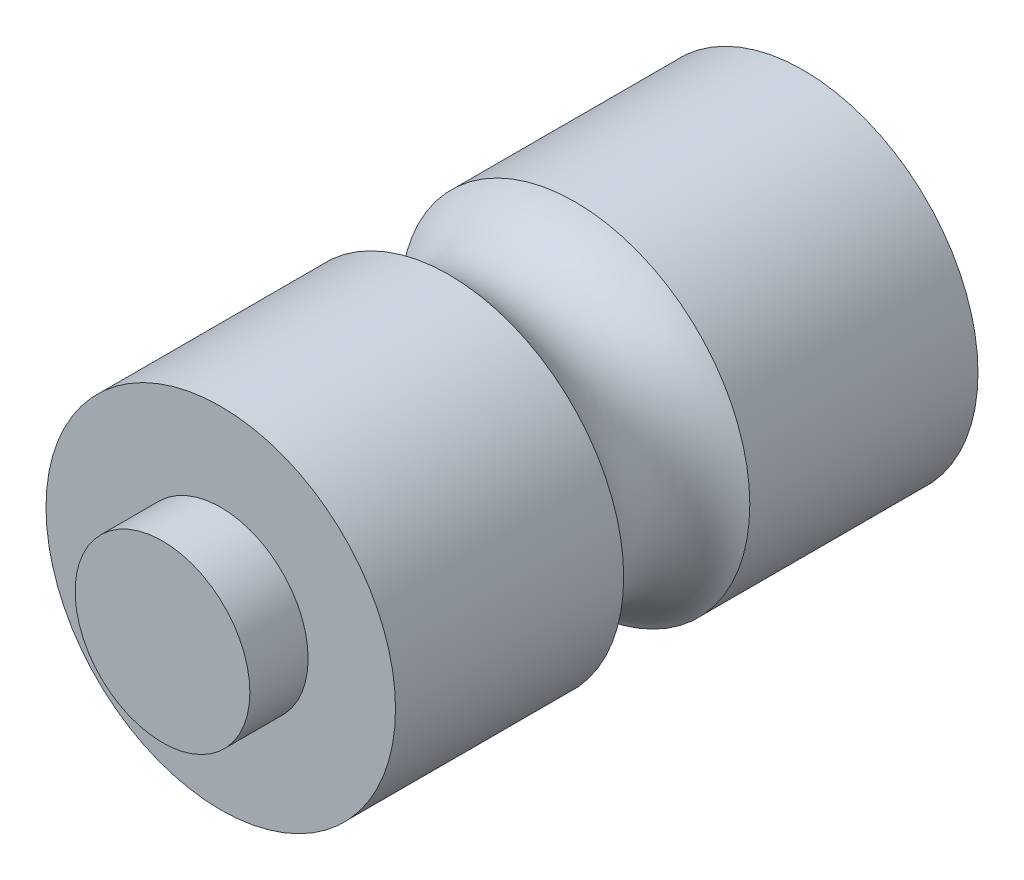
ISO-10303-21;
HEADER;
FILE_DESCRIPTION(('STEP AP214'),'2;1');
FILE_NAME('part.step','',(''),(''),'','','');
FILE_SCHEMA(('AUTOMOTIVE_DESIGN { 1 0 10303 214 1 1 1 1 }'));
ENDSEC;
DATA;
#1=APPLICATION_CONTEXT('core data for automotive mechanical design processes');
#2=APPLICATION_PROTOCOL_DEFINITION('international standard','automotive_design',2000,#1);
#3=PRODUCT_CONTEXT('',#1,'mechanical');
#4=PRODUCT('Part','Part','',(#3));
#5=PRODUCT_RELATED_PRODUCT_CATEGORY('part','',(#4));
#6=PRODUCT_DEFINITION_FORMATION('','',#4);
#7=PRODUCT_DEFINITION_CONTEXT('part definition',#1,'design');
#8=PRODUCT_DEFINITION('design','',#6,#7);
#9=PRODUCT_DEFINITION_SHAPE('','',#8);
#10=(LENGTH_UNIT() NAMED_UNIT(*) SI_UNIT(.MILLI.,.METRE.));
#11=(NAMED_UNIT(*) PLANE_ANGLE_UNIT() SI_UNIT($,.RADIAN.));
#12=(NAMED_UNIT(*) SI_UNIT($,.STERADIAN.) SOLID_ANGLE_UNIT());
#13=UNCERTAINTY_MEASURE_WITH_UNIT(LENGTH_MEASURE(1.E-05),#10,'distance_accuracy_value','');
#14=(GEOMETRIC_REPRESENTATION_CONTEXT(3) GLOBAL_UNCERTAINTY_ASSIGNED_CONTEXT((#13)) GLOBAL_UNIT_ASSIGNED_CONTEXT((#10,
#11,#12)) REPRESENTATION_CONTEXT('',''));
#15=CARTESIAN_POINT('',(0.,0.,0.));
#16=DIRECTION('',(0.,0.,1.));
#17=DIRECTION('',(1.,0.,0.));
#18=AXIS2_PLACEMENT_3D('',#15,#16,#17);
#19=CARTESIAN_POINT('',(0.,0.,25.4));
#20=DIRECTION('',(0.,0.,-1.));
#21=DIRECTION('',(-1.,0.,0.));
#22=AXIS2_PLACEMENT_3D('',#19,#20,#21);
#23=CYLINDRICAL_SURFACE('',#22,7.62);
#24=CARTESIAN_POINT('',(0.,0.,15.4496306570156));
#25=DIRECTION('',(0.,0.,1.));
#26=DIRECTION('',(1.,0.,0.));
#27=AXIS2_PLACEMENT_3D('',#24,#25,#26);
#28=CIRCLE('',#27,7.62);
#29=CARTESIAN_POINT('',(7.62,0.,15.4496306570156));
#30=VERTEX_POINT('',#29);
#31=EDGE_CURVE('E56',#30,#30,#28,.T.);
#32=ORIENTED_EDGE('',*,*,#31,.T.);
#33=EDGE_LOOP('',(#32));
#34=FACE_BOUND('',#33,.T.);
#35=CARTESIAN_POINT('',(0.,0.,25.4));
#36=DIRECTION('',(0.,0.,1.));
#37=DIRECTION('',(1.,0.,0.));
#38=AXIS2_PLACEMENT_3D('',#35,#36,#37);
#39=CIRCLE('',#38,7.62);
#40=CARTESIAN_POINT('',(7.62,0.,25.4));
#41=VERTEX_POINT('',#40);
#42=EDGE_CURVE('E44',#41,#41,#39,.T.);
#43=ORIENTED_EDGE('',*,*,#42,.F.);
#44=EDGE_LOOP('',(#43));
#45=FACE_BOUND('',#44,.T.);
#46=ADVANCED_FACE('F36',(#34,#45),#23,.T.);
#47=CARTESIAN_POINT('',(0.,0.,25.4));
#48=DIRECTION('',(0.,0.,1.));
#49=DIRECTION('',(1.,0.,0.));
#50=AXIS2_PLACEMENT_3D('',#47,#48,#49);
#51=PLANE('',#50);
#52=CARTESIAN_POINT('',(0.,0.,25.4));
#53=DIRECTION('',(0.,0.,1.));
#54=DIRECTION('',(1.,0.,0.));
#55=AXIS2_PLACEMENT_3D('',#52,#53,#54);
#56=CIRCLE('',#55,3.81);
#57=CARTESIAN_POINT('',(3.81,0.,25.4));
#58=VERTEX_POINT('',#57);
#59=EDGE_CURVE('E61',#58,#58,#56,.T.);
#60=ORIENTED_EDGE('',*,*,#59,.F.);
#61=EDGE_LOOP('',(#60));
#62=FACE_BOUND('',#61,.T.);
#63=ORIENTED_EDGE('',*,*,#42,.T.);
#64=EDGE_LOOP('',(#63));
#65=FACE_BOUND('',#64,.T.);
#66=ADVANCED_FACE('F81',(#62,#65),#51,.T.);
#67=CARTESIAN_POINT('',(0.,0.,12.7));
#68=DIRECTION('',(0.,0.,1.));
#69=DIRECTION('',(1.,0.,0.));
#70=AXIS2_PLACEMENT_3D('',#67,#68,#69);
#71=TOROIDAL_SURFACE('',#70,9.2075,3.175);
#72=CARTESIAN_POINT('',(9.2075,0.,12.7));
#73=DIRECTION('',(0.,1.,0.));
#74=DIRECTION('',(0.,0.,1.));
#75=AXIS2_PLACEMENT_3D('',#72,#73,#74);
#76=CIRCLE('',#75,3.175);
#77=CARTESIAN_POINT('',(7.62,0.,9.9503693429844));
#78=VERTEX_POINT('',#77);
#79=EDGE_CURVE('E51',#78,#30,#76,.T.);
#80=ORIENTED_EDGE('',*,*,#79,.T.);
#81=ORIENTED_EDGE('',*,*,#31,.F.);
#82=ORIENTED_EDGE('',*,*,#79,.F.);
#83=CARTESIAN_POINT('',(0.,0.,9.9503693429844));
#84=DIRECTION('',(0.,0.,1.));
#85=DIRECTION('',(1.,0.,0.));
#86=AXIS2_PLACEMENT_3D('',#83,#84,#85);
#87=CIRCLE('',#86,7.62);
#88=EDGE_CURVE('E54',#78,#78,#87,.T.);
#89=ORIENTED_EDGE('',*,*,#88,.T.);
#90=EDGE_LOOP('',(#80,#81,#82,#89));
#91=FACE_BOUND('',#90,.T.);
#92=ADVANCED_FACE('F52',(#91),#71,.F.);
#93=CARTESIAN_POINT('',(0.,0.,0.));
#94=DIRECTION('',(0.,0.,1.));
#95=DIRECTION('',(1.,0.,0.));
#96=AXIS2_PLACEMENT_3D('',#93,#94,#95);
#97=PLANE('',#96);
#98=CARTESIAN_POINT('',(0.,0.,0.));
#99=DIRECTION('',(0.,0.,1.));
#100=DIRECTION('',(1.,0.,0.));
#101=AXIS2_PLACEMENT_3D('',#98,#99,#100);
#102=CIRCLE('',#101,3.81);
#103=CARTESIAN_POINT('',(3.81,0.,0.));
#104=VERTEX_POINT('',#103);
#105=EDGE_CURVE('E11',#104,#104,#102,.F.);
#106=ORIENTED_EDGE('',*,*,#105,.F.);
#107=EDGE_LOOP('',(#106));
#108=FACE_BOUND('',#107,.T.);
#109=CARTESIAN_POINT('',(0.,0.,0.));
#110=DIRECTION('',(0.,0.,1.));
#111=DIRECTION('',(1.,0.,0.));
#112=AXIS2_PLACEMENT_3D('',#109,#110,#111);
#113=CIRCLE('',#112,7.62);
#114=CARTESIAN_POINT('',(7.62,0.,0.));
#115=VERTEX_POINT('',#114);
#116=EDGE_CURVE('E65',#115,#115,#113,.T.);
#117=ORIENTED_EDGE('',*,*,#116,.F.);
#118=EDGE_LOOP('',(#117));
#119=FACE_BOUND('',#118,.T.);
#120=ADVANCED_FACE('F72',(#108,#119),#97,.F.);
#121=ORIENTED_EDGE('',*,*,#88,.F.);
#122=EDGE_LOOP('',(#121));
#123=FACE_BOUND('',#122,.T.);
#124=ORIENTED_EDGE('',*,*,#116,.T.);
#125=EDGE_LOOP('',(#124));
#126=FACE_BOUND('',#125,.T.);
#127=ADVANCED_FACE('F38',(#123,#126),#23,.T.);
#128=CARTESIAN_POINT('',(0.,0.,27.94));
#129=DIRECTION('',(0.,0.,-1.));
#130=DIRECTION('',(-1.,0.,0.));
#131=AXIS2_PLACEMENT_3D('',#128,#129,#130);
#132=CYLINDRICAL_SURFACE('',#131,3.81);
#133=CARTESIAN_POINT('',(0.,0.,27.94));
#134=DIRECTION('',(0.,0.,1.));
#135=DIRECTION('',(1.,0.,0.));
#136=AXIS2_PLACEMENT_3D('',#133,#134,#135);
#137=CIRCLE('',#136,3.81);
#138=CARTESIAN_POINT('',(3.81,0.,27.94));
#139=VERTEX_POINT('',#138);
#140=EDGE_CURVE('E57',#139,#139,#137,.T.);
#141=ORIENTED_EDGE('',*,*,#140,.F.);
#142=EDGE_LOOP('',(#141));
#143=FACE_BOUND('',#142,.T.);
#144=ORIENTED_EDGE('',*,*,#59,.T.);
#145=EDGE_LOOP('',(#144));
#146=FACE_BOUND('',#145,.T.);
#147=ADVANCED_FACE('F79',(#143,#146),#132,.T.);
#148=CARTESIAN_POINT('',(0.,0.,27.94));
#149=DIRECTION('',(0.,0.,1.));
#150=DIRECTION('',(1.,0.,0.));
#151=AXIS2_PLACEMENT_3D('',#148,#149,#150);
#152=PLANE('',#151);
#153=ORIENTED_EDGE('',*,*,#140,.T.);
#154=EDGE_LOOP('',(#153));
#155=FACE_BOUND('',#154,.T.);
#156=ADVANCED_FACE('F100',(#155),#152,.T.);
#157=CARTESIAN_POINT('',(0.,0.,-2.54));
#158=DIRECTION('',(0.,0.,1.));
#159=DIRECTION('',(1.,0.,0.));
#160=AXIS2_PLACEMENT_3D('',#157,#158,#159);
#161=CYLINDRICAL_SURFACE('',#160,3.81);
#162=CARTESIAN_POINT('',(0.,0.,-2.54));
#163=DIRECTION('',(0.,0.,-1.));
#164=DIRECTION('',(-1.,0.,0.));
#165=AXIS2_PLACEMENT_3D('',#162,#163,#164);
#166=CIRCLE('',#165,3.81);
#167=CARTESIAN_POINT('',(-3.81,0.,-2.54));
#168=VERTEX_POINT('',#167);
#169=EDGE_CURVE('E116',#168,#168,#166,.T.);
#170=ORIENTED_EDGE('',*,*,#169,.F.);
#171=EDGE_LOOP('',(#170));
#172=FACE_BOUND('',#171,.T.);
#173=ORIENTED_EDGE('',*,*,#105,.T.);
#174=EDGE_LOOP('',(#173));
#175=FACE_BOUND('',#174,.T.);
#176=ADVANCED_FACE('F104',(#172,#175),#161,.T.);
#177=CARTESIAN_POINT('',(0.,0.,-2.54));
#178=DIRECTION('',(0.,0.,-1.));
#179=DIRECTION('',(-1.,0.,0.));
#180=AXIS2_PLACEMENT_3D('',#177,#178,#179);
#181=PLANE('',#180);
#182=ORIENTED_EDGE('',*,*,#169,.T.);
#183=EDGE_LOOP('',(#182));
#184=FACE_BOUND('',#183,.T.);
#185=ADVANCED_FACE('F108',(#184),#181,.T.);
#186=CLOSED_SHELL('',(#46,#66,#92,#120,#127,#147,#156,#176,#185));
#187=MANIFOLD_SOLID_BREP('B2',#186);
#188=ADVANCED_BREP_SHAPE_REPRESENTATION('',(#18,#187),#14);
#189=SHAPE_DEFINITION_REPRESENTATION(#9,#188);
ENDSEC;
END-ISO-10303-21;
